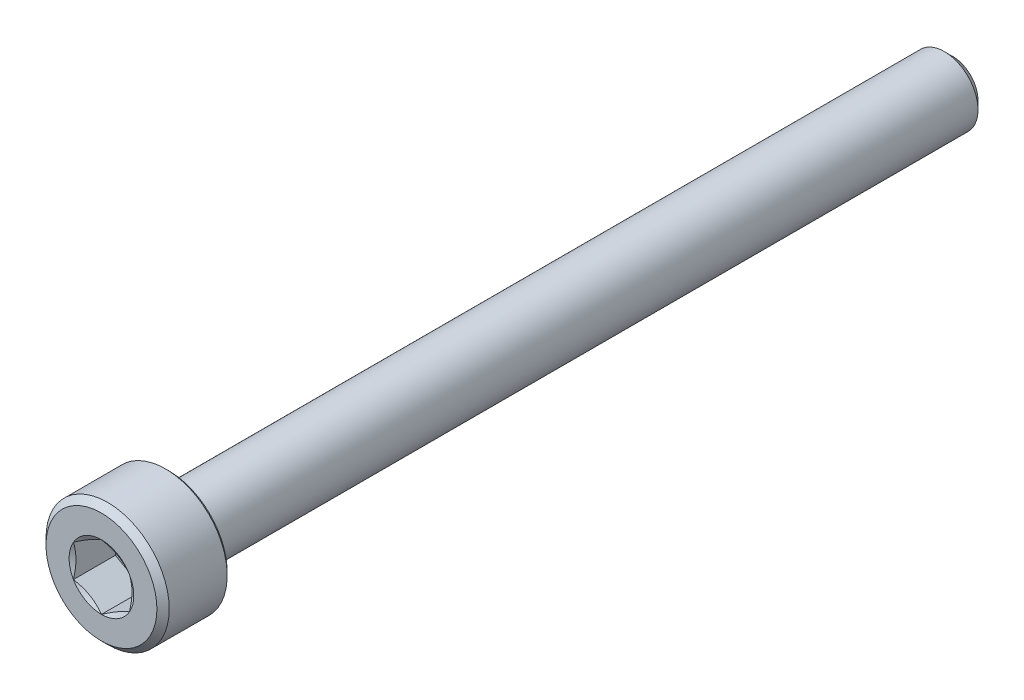
ISO-10303-21;
HEADER;
FILE_DESCRIPTION(('STEP AP214'),'2;1');
FILE_NAME('part.step','',(''),(''),'','','');
FILE_SCHEMA(('AUTOMOTIVE_DESIGN { 1 0 10303 214 1 1 1 1 }'));
ENDSEC;
DATA;
#1=APPLICATION_CONTEXT('core data for automotive mechanical design processes');
#2=APPLICATION_PROTOCOL_DEFINITION('international standard','automotive_design',2000,#1);
#3=PRODUCT_CONTEXT('',#1,'mechanical');
#4=PRODUCT('Part','Part','',(#3));
#5=PRODUCT_RELATED_PRODUCT_CATEGORY('part','',(#4));
#6=PRODUCT_DEFINITION_FORMATION('','',#4);
#7=PRODUCT_DEFINITION_CONTEXT('part definition',#1,'design');
#8=PRODUCT_DEFINITION('design','',#6,#7);
#9=PRODUCT_DEFINITION_SHAPE('','',#8);
#10=(LENGTH_UNIT() NAMED_UNIT(*) SI_UNIT(.MILLI.,.METRE.));
#11=(NAMED_UNIT(*) PLANE_ANGLE_UNIT() SI_UNIT($,.RADIAN.));
#12=(NAMED_UNIT(*) SI_UNIT($,.STERADIAN.) SOLID_ANGLE_UNIT());
#13=UNCERTAINTY_MEASURE_WITH_UNIT(LENGTH_MEASURE(1.E-05),#10,'distance_accuracy_value','');
#14=(GEOMETRIC_REPRESENTATION_CONTEXT(3) GLOBAL_UNCERTAINTY_ASSIGNED_CONTEXT((#13)) GLOBAL_UNIT_ASSIGNED_CONTEXT((#10,
#11,#12)) REPRESENTATION_CONTEXT('',''));
#15=CARTESIAN_POINT('',(0.,0.,0.));
#16=DIRECTION('',(0.,0.,1.));
#17=DIRECTION('',(1.,0.,0.));
#18=AXIS2_PLACEMENT_3D('',#15,#16,#17);
#19=CARTESIAN_POINT('',(0.,2.74999999999999,19.));
#20=DIRECTION('',(0.,0.,1.));
#21=DIRECTION('',(1.,0.,0.));
#22=AXIS2_PLACEMENT_3D('',#19,#20,#21);
#23=PLANE('',#22);
#24=CARTESIAN_POINT('',(0.,0.,19.));
#25=DIRECTION('',(0.,0.,1.));
#26=DIRECTION('',(1.,0.,0.));
#27=AXIS2_PLACEMENT_3D('',#24,#25,#26);
#28=CIRCLE('',#27,2.475);
#29=CARTESIAN_POINT('',(2.475,0.,19.));
#30=VERTEX_POINT('',#29);
#31=EDGE_CURVE('E190',#30,#30,#28,.T.);
#32=ORIENTED_EDGE('',*,*,#31,.T.);
#33=EDGE_LOOP('',(#32));
#34=FACE_BOUND('',#33,.T.);
#35=CARTESIAN_POINT('',(0.,0.,19.));
#36=DIRECTION('',(0.,0.,1.));
#37=DIRECTION('',(1.,0.,0.));
#38=AXIS2_PLACEMENT_3D('',#35,#36,#37);
#39=CIRCLE('',#38,1.44337567297406);
#40=CARTESIAN_POINT('',(1.25,0.721687836487028,19.));
#41=VERTEX_POINT('',#40);
#42=CARTESIAN_POINT('',(0.,1.44337567297406,19.));
#43=VERTEX_POINT('',#42);
#44=EDGE_CURVE('E101',#41,#43,#39,.T.);
#45=ORIENTED_EDGE('',*,*,#44,.F.);
#46=CARTESIAN_POINT('',(1.25,-0.721687836487034,19.));
#47=VERTEX_POINT('',#46);
#48=EDGE_CURVE('E61',#47,#41,#39,.T.);
#49=ORIENTED_EDGE('',*,*,#48,.F.);
#50=CARTESIAN_POINT('',(0.,-1.44337567297407,19.));
#51=VERTEX_POINT('',#50);
#52=EDGE_CURVE('E310',#51,#47,#39,.T.);
#53=ORIENTED_EDGE('',*,*,#52,.F.);
#54=CARTESIAN_POINT('',(-1.25,-0.721687836487033,19.));
#55=VERTEX_POINT('',#54);
#56=EDGE_CURVE('E68',#55,#51,#39,.T.);
#57=ORIENTED_EDGE('',*,*,#56,.F.);
#58=CARTESIAN_POINT('',(-1.25,0.721687836487032,19.));
#59=VERTEX_POINT('',#58);
#60=EDGE_CURVE('E145',#59,#55,#39,.T.);
#61=ORIENTED_EDGE('',*,*,#60,.F.);
#62=EDGE_CURVE('E111',#43,#59,#39,.T.);
#63=ORIENTED_EDGE('',*,*,#62,.F.);
#64=EDGE_LOOP('',(#45,#49,#53,#57,#61,#63));
#65=FACE_BOUND('',#64,.T.);
#66=ADVANCED_FACE('F46',(#34,#65),#23,.T.);
#67=CARTESIAN_POINT('',(0.,0.,-19.));
#68=DIRECTION('',(0.,0.,-1.));
#69=DIRECTION('',(-1.,0.,0.));
#70=AXIS2_PLACEMENT_3D('',#67,#68,#69);
#71=CYLINDRICAL_SURFACE('',#70,2.75);
#72=CARTESIAN_POINT('',(0.,0.,16.1375));
#73=DIRECTION('',(0.,0.,-1.));
#74=DIRECTION('',(-1.,0.,0.));
#75=AXIS2_PLACEMENT_3D('',#72,#73,#74);
#76=CIRCLE('',#75,2.75);
#77=CARTESIAN_POINT('',(-2.75,0.,16.1375));
#78=VERTEX_POINT('',#77);
#79=EDGE_CURVE('E198',#78,#78,#76,.F.);
#80=ORIENTED_EDGE('',*,*,#79,.T.);
#81=EDGE_LOOP('',(#80));
#82=FACE_BOUND('',#81,.T.);
#83=CARTESIAN_POINT('',(0.,0.,18.725));
#84=DIRECTION('',(0.,0.,1.));
#85=DIRECTION('',(1.,0.,0.));
#86=AXIS2_PLACEMENT_3D('',#83,#84,#85);
#87=CIRCLE('',#86,2.75);
#88=CARTESIAN_POINT('',(2.75,0.,18.725));
#89=VERTEX_POINT('',#88);
#90=EDGE_CURVE('E122',#89,#89,#87,.F.);
#91=ORIENTED_EDGE('',*,*,#90,.T.);
#92=EDGE_LOOP('',(#91));
#93=FACE_BOUND('',#92,.T.);
#94=ADVANCED_FACE('F218',(#82,#93),#71,.T.);
#95=CARTESIAN_POINT('',(0.,2.74999999999999,16.));
#96=DIRECTION('',(0.,0.,-1.));
#97=DIRECTION('',(-1.,0.,0.));
#98=AXIS2_PLACEMENT_3D('',#95,#96,#97);
#99=PLANE('',#98);
#100=CARTESIAN_POINT('',(0.,0.,16.));
#101=DIRECTION('',(0.,0.,-1.));
#102=DIRECTION('',(-1.,0.,0.));
#103=AXIS2_PLACEMENT_3D('',#100,#101,#102);
#104=CIRCLE('',#103,2.61250000000001);
#105=CARTESIAN_POINT('',(-2.61250000000001,0.,16.));
#106=VERTEX_POINT('',#105);
#107=EDGE_CURVE('E194',#106,#106,#104,.T.);
#108=ORIENTED_EDGE('',*,*,#107,.T.);
#109=EDGE_LOOP('',(#108));
#110=FACE_BOUND('',#109,.T.);
#111=CARTESIAN_POINT('',(0.,0.,16.));
#112=DIRECTION('',(0.,0.,-1.));
#113=DIRECTION('',(-1.,0.,0.));
#114=AXIS2_PLACEMENT_3D('',#111,#112,#113);
#115=CIRCLE('',#114,1.5);
#116=CARTESIAN_POINT('',(-1.5,0.,16.));
#117=VERTEX_POINT('',#116);
#118=EDGE_CURVE('E123',#117,#117,#115,.T.);
#119=ORIENTED_EDGE('',*,*,#118,.F.);
#120=EDGE_LOOP('',(#119));
#121=FACE_BOUND('',#120,.T.);
#122=ADVANCED_FACE('F226',(#110,#121),#99,.T.);
#123=CARTESIAN_POINT('',(0.,0.,-19.));
#124=DIRECTION('',(0.,0.,-1.));
#125=DIRECTION('',(-1.,0.,0.));
#126=AXIS2_PLACEMENT_3D('',#123,#124,#125);
#127=CYLINDRICAL_SURFACE('',#126,1.5);
#128=CARTESIAN_POINT('',(0.,0.,-18.625));
#129=DIRECTION('',(0.,0.,-1.));
#130=DIRECTION('',(-1.,0.,0.));
#131=AXIS2_PLACEMENT_3D('',#128,#129,#130);
#132=CIRCLE('',#131,1.5);
#133=CARTESIAN_POINT('',(-1.5,0.,-18.625));
#134=VERTEX_POINT('',#133);
#135=EDGE_CURVE('E12',#134,#134,#132,.F.);
#136=ORIENTED_EDGE('',*,*,#135,.T.);
#137=EDGE_LOOP('',(#136));
#138=FACE_BOUND('',#137,.T.);
#139=ORIENTED_EDGE('',*,*,#118,.T.);
#140=EDGE_LOOP('',(#139));
#141=FACE_BOUND('',#140,.T.);
#142=ADVANCED_FACE('F333',(#138,#141),#127,.T.);
#143=CARTESIAN_POINT('',(0.,1.49999999999999,-19.));
#144=DIRECTION('',(0.,0.,-1.));
#145=DIRECTION('',(-1.,0.,0.));
#146=AXIS2_PLACEMENT_3D('',#143,#144,#145);
#147=PLANE('',#146);
#148=CARTESIAN_POINT('',(0.,0.,-19.));
#149=DIRECTION('',(0.,0.,-1.));
#150=DIRECTION('',(-1.,0.,0.));
#151=AXIS2_PLACEMENT_3D('',#148,#149,#150);
#152=CIRCLE('',#151,1.125);
#153=CARTESIAN_POINT('',(-1.125,0.,-19.));
#154=VERTEX_POINT('',#153);
#155=EDGE_CURVE('E55',#154,#154,#152,.T.);
#156=ORIENTED_EDGE('',*,*,#155,.T.);
#157=EDGE_LOOP('',(#156));
#158=FACE_BOUND('',#157,.T.);
#159=ADVANCED_FACE('F205',(#158),#147,.T.);
#160=CARTESIAN_POINT('',(0.,0.,19.));
#161=DIRECTION('',(0.,0.,1.));
#162=DIRECTION('',(1.,0.,0.));
#163=AXIS2_PLACEMENT_3D('',#160,#161,#162);
#164=CONICAL_SURFACE('',#163,1.44337567297406,1.0471975511966);
#165=ORIENTED_EDGE('',*,*,#62,.T.);
#166=CARTESIAN_POINT('',(0.000199999999999545,1.4434911430279,19.000066674666));
#167=CARTESIAN_POINT('',(-0.0547333052317655,1.41177538446486,18.9817459147637));
#168=CARTESIAN_POINT('',(-0.11014078650024,1.37978586023939,18.9650833062006));
#169=CARTESIAN_POINT('',(-0.22191536760034,1.31525277575269,18.9359973039458));
#170=CARTESIAN_POINT('',(-0.278284454841711,1.28270806805991,18.9235842019761));
#171=CARTESIAN_POINT('',(-0.390323974086985,1.21802202146378,18.904259687636));
#172=CARTESIAN_POINT('',(-0.44597715845923,1.1858906404852,18.8972196894474));
#173=CARTESIAN_POINT('',(-0.557545653908392,1.12147653960455,18.8888124326306));
#174=CARTESIAN_POINT('',(-0.613460558937601,1.08919405413422,18.8874382152047));
#175=CARTESIAN_POINT('',(-0.717957921181725,1.02886247391297,18.8902833373679));
#176=CARTESIAN_POINT('',(-0.766555949881316,1.00080438896118,18.89380409882));
#177=CARTESIAN_POINT('',(-0.863435362173239,0.944871034195501,18.9049671126993));
#178=CARTESIAN_POINT('',(-0.911716410192164,0.916995958125017,18.9126131855727));
#179=CARTESIAN_POINT('',(-1.00879588385404,0.860947097873544,18.9317294547005));
#180=CARTESIAN_POINT('',(-1.0575820103519,0.832780414607287,18.9432807569797));
#181=CARTESIAN_POINT('',(-1.1544262522921,0.776867365453646,18.9694983146939));
#182=CARTESIAN_POINT('',(-1.20248561032696,0.749120282155138,18.9841584021391));
#183=CARTESIAN_POINT('',(-1.2502,0.721572366433192,19.000066674666));
#184=B_SPLINE_CURVE_WITH_KNOTS('',3,(#166,#167,#168,#169,#170,#171,#172,#173,#174,#175,#176,
#177,#178,#179,#180,#181,#182,#183),.UNSPECIFIED.,.F.,.F.,(4,2,2,2,2,2,2,2,4),(0.,
0.198150821029559,0.396778196315221,0.5904886173544,0.783961049317182,0.952480056398646,
1.1211553973001,1.2935743034359,1.4656542697693),.UNSPECIFIED.);
#185=EDGE_CURVE('E116',#43,#59,#184,.T.);
#186=ORIENTED_EDGE('',*,*,#185,.F.);
#187=EDGE_LOOP('',(#165,#186));
#188=FACE_BOUND('',#187,.T.);
#189=ADVANCED_FACE('F117',(#188),#164,.F.);
#190=ORIENTED_EDGE('',*,*,#60,.T.);
#191=CARTESIAN_POINT('',(-1.25,-1.86893140179217,19.4647941109243));
#192=CARTESIAN_POINT('',(-1.25,-1.81495202267025,19.4388968384665));
#193=CARTESIAN_POINT('',(-1.25,-1.76084125344196,19.4132686219312));
#194=CARTESIAN_POINT('',(-1.25,-1.65228662652066,19.3627027606134));
#195=CARTESIAN_POINT('',(-1.25,-1.59784271100767,19.3377652401103));
#196=CARTESIAN_POINT('',(-1.25,-1.48823931692675,19.2885939163498));
#197=CARTESIAN_POINT('',(-1.25,-1.43307750108907,19.2643652994868));
#198=CARTESIAN_POINT('',(-1.25,-1.32229188443621,19.2169950705039));
#199=CARTESIAN_POINT('',(-1.25,-1.26666810781962,19.1938534018645));
#200=CARTESIAN_POINT('',(-1.25,-1.15340083047608,19.1483546130678));
#201=CARTESIAN_POINT('',(-1.25,-1.09574254265115,19.1260338154653));
#202=CARTESIAN_POINT('',(-1.25,-0.979741082890175,19.083255476912));
#203=CARTESIAN_POINT('',(-1.25,-0.921397826164638,19.0627981694397));
#204=CARTESIAN_POINT('',(-1.25,-0.745435524772241,19.0050842376762));
#205=CARTESIAN_POINT('',(-1.25,-0.62656193813286,18.9713502149769));
#206=CARTESIAN_POINT('',(-1.25,-0.445873083681239,18.9322204068282));
#207=CARTESIAN_POINT('',(-1.25,-0.385304700192768,18.9210940606189));
#208=CARTESIAN_POINT('',(-1.25,-0.26348659206503,18.9034278522676));
#209=CARTESIAN_POINT('',(-1.25,-0.202236913753247,18.8968876801832));
#210=CARTESIAN_POINT('',(-1.25,-0.0801324468775849,18.8889987810428));
#211=CARTESIAN_POINT('',(-1.25,-0.0192817197887167,18.8875887912582));
#212=CARTESIAN_POINT('',(-1.25,0.102319232701152,18.8899161878862));
#213=CARTESIAN_POINT('',(-1.25,0.163069451645859,18.893653893026));
#214=CARTESIAN_POINT('',(-1.25,0.312961598922923,18.9088980280361));
#215=CARTESIAN_POINT('',(-1.25,0.401813055628259,18.9232612484297));
#216=CARTESIAN_POINT('',(-1.25,0.577788146583198,18.9602998495149));
#217=CARTESIAN_POINT('',(-1.25,0.664909564430747,18.9829852483542));
#218=CARTESIAN_POINT('',(-1.25,0.795209224728791,19.0217374532821));
#219=CARTESIAN_POINT('',(-1.25,0.839061001813533,19.0356229448103));
#220=CARTESIAN_POINT('',(-1.25,0.926308087473953,19.0646784153621));
#221=CARTESIAN_POINT('',(-1.25,0.969703662172459,19.0798475927664));
#222=CARTESIAN_POINT('',(-1.25,1.05609633508794,19.1112501339966));
#223=CARTESIAN_POINT('',(-1.25,1.09909350410933,19.127483304423));
#224=CARTESIAN_POINT('',(-1.25,1.18474903910479,19.1608382439108));
#225=CARTESIAN_POINT('',(-1.25,1.22740734642399,19.1779601631043));
#226=CARTESIAN_POINT('',(-1.25,1.33629459550825,19.2227614292321));
#227=CARTESIAN_POINT('',(-1.25,1.40230581092028,19.2509693835735));
#228=CARTESIAN_POINT('',(-1.25,1.53373213594212,19.3087450811585));
#229=CARTESIAN_POINT('',(-1.25,1.59914720045374,19.3383129262699));
#230=CARTESIAN_POINT('',(-1.25,1.79469680395942,19.4285769200244));
#231=CARTESIAN_POINT('',(-1.25,1.92411390982368,19.4908242731852));
#232=CARTESIAN_POINT('',(-1.25,2.18184246876936,19.6179296229027));
#233=CARTESIAN_POINT('',(-1.25,2.31015236703661,19.682790734765));
#234=CARTESIAN_POINT('',(-1.25,2.56589305685455,19.8141807455314));
#235=CARTESIAN_POINT('',(-1.25,2.69332395754888,19.8807094324427));
#236=CARTESIAN_POINT('',(-1.25,2.93557826301822,20.0085820016458));
#237=CARTESIAN_POINT('',(-1.25,3.05045639113076,20.0698225704122));
#238=CARTESIAN_POINT('',(-1.25,3.27984311898855,20.1930014800409));
#239=CARTESIAN_POINT('',(-1.25,3.39435170485538,20.2549398467261));
#240=CARTESIAN_POINT('',(-1.25,3.62279327872168,20.3791811560561));
#241=CARTESIAN_POINT('',(-1.25,3.73672698995313,20.441482770676));
#242=CARTESIAN_POINT('',(-1.25,3.96436406629495,20.5664914919315));
#243=CARTESIAN_POINT('',(-1.25,4.07806744314788,20.6291985771761));
#244=CARTESIAN_POINT('',(-1.25,4.19168806612954,20.6920543493623));
#245=B_SPLINE_CURVE_WITH_KNOTS('',3,(#191,#192,#193,#194,#195,#196,#197,#198,#199,#200,#201,
#202,#203,#204,#205,#206,#207,#208,#209,#210,#211,#212,#213,#214,#215,#216,#217,#218,#219,#220,
#221,#222,#223,#224,#225,#226,#227,#228,#229,#230,#231,#232,#233,#234,#235,#236,#237,#238,#239,
#240,#241,#242,#243,#244),.UNSPECIFIED.,.F.,.F.,(4,2,2,2,2,2,2,2,2,2,2,2,2,2,2,2,2,2,2,2,2,2,2,
2,2,2,4),(0.,0.179612926712514,0.359257964580623,0.539992735616907,0.720718098311213,
0.906167781883877,1.09164066876278,1.4615401462125,1.64614554413147,1.83073846485712,
2.0131196740194,2.19551217609307,2.46497297688035,2.73475922178117,2.87273702323329,
3.01062928909397,3.14849655975686,3.28638719597089,3.50172172546908,3.7170724117864,
4.14784491349865,4.57914698286382,5.01039449766869,5.40093821140478,5.79149642546539,
6.18106124184771,6.57060567131893),.UNSPECIFIED.);
#246=EDGE_CURVE('E110',#59,#55,#245,.F.);
#247=ORIENTED_EDGE('',*,*,#246,.F.);
#248=EDGE_LOOP('',(#190,#247));
#249=FACE_BOUND('',#248,.T.);
#250=ADVANCED_FACE('F321',(#249),#164,.F.);
#251=ORIENTED_EDGE('',*,*,#56,.T.);
#252=CARTESIAN_POINT('',(-1.2502,-0.721572366433196,19.000066674666));
#253=CARTESIAN_POINT('',(-1.19526669476823,-0.753288124996232,18.9817459147637));
#254=CARTESIAN_POINT('',(-1.13985921349976,-0.785277649221705,18.9650833062006));
#255=CARTESIAN_POINT('',(-1.02808463239966,-0.849810733708405,18.9359973039458));
#256=CARTESIAN_POINT('',(-0.971715545158289,-0.882355441401184,18.9235842019761));
#257=CARTESIAN_POINT('',(-0.859676025913015,-0.947041487997319,18.904259687636));
#258=CARTESIAN_POINT('',(-0.80402284154077,-0.979172868975895,18.8972196894474));
#259=CARTESIAN_POINT('',(-0.692454346091608,-1.04358696985655,18.8888124326306));
#260=CARTESIAN_POINT('',(-0.636539441062399,-1.07586945532688,18.8874382152047));
#261=CARTESIAN_POINT('',(-0.532042078818274,-1.13620103554813,18.8902833373679));
#262=CARTESIAN_POINT('',(-0.483444050118683,-1.16425912049992,18.89380409882));
#263=CARTESIAN_POINT('',(-0.38656463782676,-1.2201924752656,18.9049671126993));
#264=CARTESIAN_POINT('',(-0.338283589807835,-1.24806755133608,18.9126131855727));
#265=CARTESIAN_POINT('',(-0.241204116145956,-1.30411641158755,18.9317294547005));
#266=CARTESIAN_POINT('',(-0.192417989648099,-1.33228309485381,18.9432807569797));
#267=CARTESIAN_POINT('',(-0.0955737477078969,-1.38819614400745,18.9694983146939));
#268=CARTESIAN_POINT('',(-0.0475143896730349,-1.41594322730596,18.9841584021391));
#269=CARTESIAN_POINT('',(0.000200000000000781,-1.4434911430279,19.000066674666));
#270=B_SPLINE_CURVE_WITH_KNOTS('',3,(#252,#253,#254,#255,#256,#257,#258,#259,#260,#261,#262,
#263,#264,#265,#266,#267,#268,#269),.UNSPECIFIED.,.F.,.F.,(4,2,2,2,2,2,2,2,4),(0.,
0.19815082102956,0.396778196315222,0.590488617354401,0.783961049317183,0.952480056398648,
1.1211553973001,1.2935743034359,1.4656542697693),.UNSPECIFIED.);
#271=EDGE_CURVE('E158',#55,#51,#270,.T.);
#272=ORIENTED_EDGE('',*,*,#271,.F.);
#273=EDGE_LOOP('',(#251,#272));
#274=FACE_BOUND('',#273,.T.);
#275=ADVANCED_FACE('F319',(#274),#164,.F.);
#276=ORIENTED_EDGE('',*,*,#52,.T.);
#277=CARTESIAN_POINT('',(-0.000199999999999969,-1.4434911430279,19.000066674666));
#278=CARTESIAN_POINT('',(0.0547333052317653,-1.41177538446487,18.9817459147637));
#279=CARTESIAN_POINT('',(0.11014078650024,-1.3797858602394,18.9650833062006));
#280=CARTESIAN_POINT('',(0.221915367600341,-1.31525277575269,18.9359973039458));
#281=CARTESIAN_POINT('',(0.278284454841711,-1.28270806805992,18.9235842019761));
#282=CARTESIAN_POINT('',(0.390323974086985,-1.21802202146378,18.904259687636));
#283=CARTESIAN_POINT('',(0.445977158459231,-1.1858906404852,18.8972196894474));
#284=CARTESIAN_POINT('',(0.557545653908393,-1.12147653960455,18.8888124326306));
#285=CARTESIAN_POINT('',(0.613460558937601,-1.08919405413422,18.8874382152047));
#286=CARTESIAN_POINT('',(0.717957921181726,-1.02886247391297,18.8902833373679));
#287=CARTESIAN_POINT('',(0.766555949881316,-1.00080438896118,18.89380409882));
#288=CARTESIAN_POINT('',(0.863435362173238,-0.944871034195505,18.9049671126993));
#289=CARTESIAN_POINT('',(0.911716410192163,-0.916995958125022,18.9126131855727));
#290=CARTESIAN_POINT('',(1.00879588385404,-0.860947097873548,18.9317294547005));
#291=CARTESIAN_POINT('',(1.0575820103519,-0.832780414607291,18.9432807569797));
#292=CARTESIAN_POINT('',(1.1544262522921,-0.77686736545365,18.9694983146939));
#293=CARTESIAN_POINT('',(1.20248561032696,-0.749120282155142,18.9841584021391));
#294=CARTESIAN_POINT('',(1.2502,-0.721572366433196,19.000066674666));
#295=B_SPLINE_CURVE_WITH_KNOTS('',3,(#277,#278,#279,#280,#281,#282,#283,#284,#285,#286,#287,
#288,#289,#290,#291,#292,#293,#294),.UNSPECIFIED.,.F.,.F.,(4,2,2,2,2,2,2,2,4),(0.,
0.198150821029561,0.396778196315223,0.590488617354401,0.783961049317183,0.952480056398647,
1.1211553973001,1.2935743034359,1.4656542697693),.UNSPECIFIED.);
#296=EDGE_CURVE('E257',#51,#47,#295,.T.);
#297=ORIENTED_EDGE('',*,*,#296,.F.);
#298=EDGE_LOOP('',(#276,#297));
#299=FACE_BOUND('',#298,.T.);
#300=ADVANCED_FACE('F311',(#299),#164,.F.);
#301=ORIENTED_EDGE('',*,*,#48,.T.);
#302=CARTESIAN_POINT('',(1.25,-1.86893140179217,19.4647941109243));
#303=CARTESIAN_POINT('',(1.25,-1.81495202267025,19.4388968384665));
#304=CARTESIAN_POINT('',(1.25,-1.76084125344196,19.4132686219312));
#305=CARTESIAN_POINT('',(1.25,-1.65228662652066,19.3627027606134));
#306=CARTESIAN_POINT('',(1.25,-1.59784271100767,19.3377652401103));
#307=CARTESIAN_POINT('',(1.25,-1.48823931692675,19.2885939163498));
#308=CARTESIAN_POINT('',(1.25,-1.43307750108907,19.2643652994868));
#309=CARTESIAN_POINT('',(1.25,-1.32229188443621,19.2169950705039));
#310=CARTESIAN_POINT('',(1.25,-1.26666810781962,19.1938534018645));
#311=CARTESIAN_POINT('',(1.25,-1.15340083047608,19.1483546130678));
#312=CARTESIAN_POINT('',(1.25,-1.09574254265115,19.1260338154653));
#313=CARTESIAN_POINT('',(1.25,-0.979741082890175,19.083255476912));
#314=CARTESIAN_POINT('',(1.25,-0.921397826164639,19.0627981694397));
#315=CARTESIAN_POINT('',(1.25,-0.745435524772241,19.0050842376762));
#316=CARTESIAN_POINT('',(1.25,-0.626561938132861,18.9713502149769));
#317=CARTESIAN_POINT('',(1.25,-0.445873083681239,18.9322204068282));
#318=CARTESIAN_POINT('',(1.25,-0.385304700192768,18.9210940606189));
#319=CARTESIAN_POINT('',(1.25,-0.26348659206503,18.9034278522676));
#320=CARTESIAN_POINT('',(1.25,-0.202236913753247,18.8968876801832));
#321=CARTESIAN_POINT('',(1.25,-0.0801324468775847,18.8889987810428));
#322=CARTESIAN_POINT('',(1.25,-0.0192817197887163,18.8875887912582));
#323=CARTESIAN_POINT('',(1.25,0.102319232701152,18.8899161878862));
#324=CARTESIAN_POINT('',(1.25,0.16306945164586,18.893653893026));
#325=CARTESIAN_POINT('',(1.25,0.312961598922924,18.9088980280361));
#326=CARTESIAN_POINT('',(1.25,0.40181305562826,18.9232612484297));
#327=CARTESIAN_POINT('',(1.25,0.577788146583198,18.9602998495149));
#328=CARTESIAN_POINT('',(1.25,0.664909564430748,18.9829852483542));
#329=CARTESIAN_POINT('',(1.25,0.795209224728792,19.0217374532821));
#330=CARTESIAN_POINT('',(1.25,0.839061001813534,19.0356229448103));
#331=CARTESIAN_POINT('',(1.25,0.926308087473953,19.0646784153621));
#332=CARTESIAN_POINT('',(1.25,0.96970366217246,19.0798475927664));
#333=CARTESIAN_POINT('',(1.25,1.05609633508794,19.1112501339966));
#334=CARTESIAN_POINT('',(1.25,1.09909350410933,19.127483304423));
#335=CARTESIAN_POINT('',(1.25,1.1847490391048,19.1608382439108));
#336=CARTESIAN_POINT('',(1.25,1.22740734642399,19.1779601631043));
#337=CARTESIAN_POINT('',(1.25,1.33629459550825,19.2227614292321));
#338=CARTESIAN_POINT('',(1.25,1.40230581092028,19.2509693835735));
#339=CARTESIAN_POINT('',(1.25,1.53373213594212,19.3087450811585));
#340=CARTESIAN_POINT('',(1.25,1.59914720045374,19.3383129262699));
#341=CARTESIAN_POINT('',(1.25,1.79469680395942,19.4285769200244));
#342=CARTESIAN_POINT('',(1.25,1.92411390982368,19.4908242731852));
#343=CARTESIAN_POINT('',(1.25,2.18184246876936,19.6179296229027));
#344=CARTESIAN_POINT('',(1.25,2.31015236703661,19.682790734765));
#345=CARTESIAN_POINT('',(1.25,2.56589305685455,19.8141807455314));
#346=CARTESIAN_POINT('',(1.25,2.69332395754888,19.8807094324427));
#347=CARTESIAN_POINT('',(1.25,2.93557826301822,20.0085820016458));
#348=CARTESIAN_POINT('',(1.25,3.05045639113076,20.0698225704122));
#349=CARTESIAN_POINT('',(1.25,3.27984311898855,20.1930014800409));
#350=CARTESIAN_POINT('',(1.25,3.39435170485538,20.2549398467262));
#351=CARTESIAN_POINT('',(1.25,3.62279327872168,20.3791811560561));
#352=CARTESIAN_POINT('',(1.25,3.73672698995313,20.441482770676));
#353=CARTESIAN_POINT('',(1.25,3.96436406629495,20.5664914919315));
#354=CARTESIAN_POINT('',(1.25,4.07806744314788,20.6291985771761));
#355=CARTESIAN_POINT('',(1.25,4.19168806612954,20.6920543493623));
#356=B_SPLINE_CURVE_WITH_KNOTS('',3,(#302,#303,#304,#305,#306,#307,#308,#309,#310,#311,#312,
#313,#314,#315,#316,#317,#318,#319,#320,#321,#322,#323,#324,#325,#326,#327,#328,#329,#330,#331,
#332,#333,#334,#335,#336,#337,#338,#339,#340,#341,#342,#343,#344,#345,#346,#347,#348,#349,#350,
#351,#352,#353,#354,#355),.UNSPECIFIED.,.F.,.F.,(4,2,2,2,2,2,2,2,2,2,2,2,2,2,2,2,2,2,2,2,2,2,2,
2,2,2,4),(0.,0.179612926712516,0.359257964580625,0.539992735616909,0.720718098311215,
0.906167781883879,1.09164066876279,1.4615401462125,1.64614554413147,1.83073846485713,
2.01311967401941,2.19551217609307,2.46497297688035,2.73475922178117,2.87273702323329,
3.01062928909397,3.14849655975687,3.28638719597089,3.50172172546908,3.7170724117864,
4.14784491349865,4.57914698286382,5.01039449766869,5.40093821140478,5.79149642546539,
6.18106124184772,6.57060567131893),.UNSPECIFIED.);
#357=EDGE_CURVE('E134',#47,#41,#356,.T.);
#358=ORIENTED_EDGE('',*,*,#357,.F.);
#359=EDGE_LOOP('',(#301,#358));
#360=FACE_BOUND('',#359,.T.);
#361=ADVANCED_FACE('F307',(#360),#164,.F.);
#362=ORIENTED_EDGE('',*,*,#44,.T.);
#363=CARTESIAN_POINT('',(1.2502,0.721572366433193,19.000066674666));
#364=CARTESIAN_POINT('',(1.19526669476823,0.753288124996229,18.9817459147637));
#365=CARTESIAN_POINT('',(1.13985921349976,0.785277649221701,18.9650833062006));
#366=CARTESIAN_POINT('',(1.02808463239966,0.849810733708402,18.9359973039458));
#367=CARTESIAN_POINT('',(0.971715545158289,0.882355441401181,18.9235842019761));
#368=CARTESIAN_POINT('',(0.859676025913015,0.947041487997316,18.904259687636));
#369=CARTESIAN_POINT('',(0.80402284154077,0.979172868975891,18.8972196894474));
#370=CARTESIAN_POINT('',(0.692454346091608,1.04358696985655,18.8888124326306));
#371=CARTESIAN_POINT('',(0.636539441062399,1.07586945532687,18.8874382152047));
#372=CARTESIAN_POINT('',(0.532042078818274,1.13620103554812,18.8902833373679));
#373=CARTESIAN_POINT('',(0.483444050118684,1.16425912049992,18.89380409882));
#374=CARTESIAN_POINT('',(0.386564637826761,1.22019247526559,18.9049671126993));
#375=CARTESIAN_POINT('',(0.338283589807836,1.24806755133608,18.9126131855727));
#376=CARTESIAN_POINT('',(0.241204116145956,1.30411641158755,18.9317294547005));
#377=CARTESIAN_POINT('',(0.1924179896481,1.33228309485381,18.9432807569797));
#378=CARTESIAN_POINT('',(0.0955737477078973,1.38819614400745,18.9694983146939));
#379=CARTESIAN_POINT('',(0.0475143896730351,1.41594322730595,18.9841584021391));
#380=CARTESIAN_POINT('',(-0.00020000000000046,1.4434911430279,19.000066674666));
#381=B_SPLINE_CURVE_WITH_KNOTS('',3,(#363,#364,#365,#366,#367,#368,#369,#370,#371,#372,#373,
#374,#375,#376,#377,#378,#379,#380),.UNSPECIFIED.,.F.,.F.,(4,2,2,2,2,2,2,2,4),(0.,
0.198150821029558,0.396778196315221,0.5904886173544,0.783961049317182,0.952480056398646,
1.1211553973001,1.2935743034359,1.4656542697693),.UNSPECIFIED.);
#382=EDGE_CURVE('E105',#41,#43,#381,.T.);
#383=ORIENTED_EDGE('',*,*,#382,.F.);
#384=EDGE_LOOP('',(#362,#383));
#385=FACE_BOUND('',#384,.T.);
#386=ADVANCED_FACE('F103',(#385),#164,.F.);
#387=CARTESIAN_POINT('',(0.,0.,17.125));
#388=DIRECTION('',(0.,0.,1.));
#389=DIRECTION('',(1.,0.,0.));
#390=AXIS2_PLACEMENT_3D('',#387,#388,#389);
#391=PLANE('',#390);
#392=DIRECTION('',(-0.866025403784439,0.5,0.));
#393=VECTOR('',#392,1.);
#394=CARTESIAN_POINT('',(1.25,0.721687836487031,17.125));
#395=LINE('',#394,#393);
#396=CARTESIAN_POINT('',(1.25,0.721687836487031,17.125));
#397=VERTEX_POINT('',#396);
#398=CARTESIAN_POINT('',(0.,1.44337567297406,17.125));
#399=VERTEX_POINT('',#398);
#400=EDGE_CURVE('E133',#397,#399,#395,.T.);
#401=ORIENTED_EDGE('',*,*,#400,.T.);
#402=DIRECTION('',(-0.866025403784438,-0.5,0.));
#403=VECTOR('',#402,1.);
#404=CARTESIAN_POINT('',(0.,1.44337567297406,17.125));
#405=LINE('',#404,#403);
#406=CARTESIAN_POINT('',(-1.25,0.72168783648703,17.125));
#407=VERTEX_POINT('',#406);
#408=EDGE_CURVE('E138',#399,#407,#405,.T.);
#409=ORIENTED_EDGE('',*,*,#408,.T.);
#410=DIRECTION('',(0.,-1.,0.));
#411=VECTOR('',#410,1.);
#412=CARTESIAN_POINT('',(-1.25,0.72168783648703,17.125));
#413=LINE('',#412,#411);
#414=CARTESIAN_POINT('',(-1.25,-0.721687836487034,17.125));
#415=VERTEX_POINT('',#414);
#416=EDGE_CURVE('E271',#407,#415,#413,.T.);
#417=ORIENTED_EDGE('',*,*,#416,.T.);
#418=DIRECTION('',(0.866025403784439,-0.5,0.));
#419=VECTOR('',#418,1.);
#420=CARTESIAN_POINT('',(-1.25,-0.721687836487034,17.125));
#421=LINE('',#420,#419);
#422=CARTESIAN_POINT('',(0.,-1.44337567297407,17.125));
#423=VERTEX_POINT('',#422);
#424=EDGE_CURVE('E275',#415,#423,#421,.T.);
#425=ORIENTED_EDGE('',*,*,#424,.T.);
#426=DIRECTION('',(0.866025403784439,0.5,0.));
#427=VECTOR('',#426,1.);
#428=CARTESIAN_POINT('',(0.,-1.44337567297407,17.125));
#429=LINE('',#428,#427);
#430=CARTESIAN_POINT('',(1.25,-0.721687836487034,17.125));
#431=VERTEX_POINT('',#430);
#432=EDGE_CURVE('E279',#423,#431,#429,.T.);
#433=ORIENTED_EDGE('',*,*,#432,.T.);
#434=DIRECTION('',(0.,1.,0.));
#435=VECTOR('',#434,1.);
#436=CARTESIAN_POINT('',(1.25,-0.721687836487034,17.125));
#437=LINE('',#436,#435);
#438=EDGE_CURVE('E142',#431,#397,#437,.T.);
#439=ORIENTED_EDGE('',*,*,#438,.T.);
#440=EDGE_LOOP('',(#401,#409,#417,#425,#433,#439));
#441=FACE_BOUND('',#440,.T.);
#442=ADVANCED_FACE('F178',(#441),#391,.T.);
#443=CARTESIAN_POINT('',(0.,1.44337567297406,17.125));
#444=DIRECTION('',(-0.5,0.866025403784438,0.));
#445=DIRECTION('',(-0.866025403784439,-0.5,0.));
#446=AXIS2_PLACEMENT_3D('',#443,#444,#445);
#447=PLANE('',#446);
#448=DIRECTION('',(0.,0.,1.));
#449=VECTOR('',#448,1.);
#450=CARTESIAN_POINT('',(0.,1.44337567297406,17.125));
#451=LINE('',#450,#449);
#452=EDGE_CURVE('E129',#399,#43,#451,.T.);
#453=ORIENTED_EDGE('',*,*,#452,.T.);
#454=ORIENTED_EDGE('',*,*,#185,.T.);
#455=DIRECTION('',(0.,0.,1.));
#456=VECTOR('',#455,1.);
#457=CARTESIAN_POINT('',(-1.25,0.72168783648703,17.125));
#458=LINE('',#457,#456);
#459=EDGE_CURVE('E141',#407,#59,#458,.T.);
#460=ORIENTED_EDGE('',*,*,#459,.F.);
#461=ORIENTED_EDGE('',*,*,#408,.F.);
#462=EDGE_LOOP('',(#453,#454,#460,#461));
#463=FACE_BOUND('',#462,.T.);
#464=ADVANCED_FACE('F136',(#463),#447,.F.);
#465=CARTESIAN_POINT('',(-1.25,0.72168783648703,17.125));
#466=DIRECTION('',(-1.,0.,0.));
#467=DIRECTION('',(0.,-1.,0.));
#468=AXIS2_PLACEMENT_3D('',#465,#466,#467);
#469=PLANE('',#468);
#470=ORIENTED_EDGE('',*,*,#459,.T.);
#471=ORIENTED_EDGE('',*,*,#246,.T.);
#472=DIRECTION('',(0.,0.,1.));
#473=VECTOR('',#472,1.);
#474=CARTESIAN_POINT('',(-1.25,-0.721687836487034,17.125));
#475=LINE('',#474,#473);
#476=EDGE_CURVE('E295',#415,#55,#475,.T.);
#477=ORIENTED_EDGE('',*,*,#476,.F.);
#478=ORIENTED_EDGE('',*,*,#416,.F.);
#479=EDGE_LOOP('',(#470,#471,#477,#478));
#480=FACE_BOUND('',#479,.T.);
#481=ADVANCED_FACE('F167',(#480),#469,.F.);
#482=CARTESIAN_POINT('',(-1.25,-0.721687836487034,17.125));
#483=DIRECTION('',(-0.5,-0.866025403784439,0.));
#484=DIRECTION('',(0.866025403784439,-0.5,0.));
#485=AXIS2_PLACEMENT_3D('',#482,#483,#484);
#486=PLANE('',#485);
#487=ORIENTED_EDGE('',*,*,#476,.T.);
#488=ORIENTED_EDGE('',*,*,#271,.T.);
#489=DIRECTION('',(0.,0.,1.));
#490=VECTOR('',#489,1.);
#491=CARTESIAN_POINT('',(0.,-1.44337567297407,17.125));
#492=LINE('',#491,#490);
#493=EDGE_CURVE('E291',#423,#51,#492,.T.);
#494=ORIENTED_EDGE('',*,*,#493,.F.);
#495=ORIENTED_EDGE('',*,*,#424,.F.);
#496=EDGE_LOOP('',(#487,#488,#494,#495));
#497=FACE_BOUND('',#496,.T.);
#498=ADVANCED_FACE('F171',(#497),#486,.F.);
#499=CARTESIAN_POINT('',(0.,-1.44337567297407,17.125));
#500=DIRECTION('',(0.5,-0.866025403784439,0.));
#501=DIRECTION('',(0.866025403784439,0.5,0.));
#502=AXIS2_PLACEMENT_3D('',#499,#500,#501);
#503=PLANE('',#502);
#504=ORIENTED_EDGE('',*,*,#493,.T.);
#505=ORIENTED_EDGE('',*,*,#296,.T.);
#506=DIRECTION('',(0.,0.,1.));
#507=VECTOR('',#506,1.);
#508=CARTESIAN_POINT('',(1.25,-0.721687836487034,17.125));
#509=LINE('',#508,#507);
#510=EDGE_CURVE('E288',#431,#47,#509,.T.);
#511=ORIENTED_EDGE('',*,*,#510,.F.);
#512=ORIENTED_EDGE('',*,*,#432,.F.);
#513=EDGE_LOOP('',(#504,#505,#511,#512));
#514=FACE_BOUND('',#513,.T.);
#515=ADVANCED_FACE('F242',(#514),#503,.F.);
#516=CARTESIAN_POINT('',(1.25,-0.721687836487034,17.125));
#517=DIRECTION('',(1.,0.,0.));
#518=DIRECTION('',(0.,0.,-1.));
#519=AXIS2_PLACEMENT_3D('',#516,#517,#518);
#520=PLANE('',#519);
#521=ORIENTED_EDGE('',*,*,#510,.T.);
#522=ORIENTED_EDGE('',*,*,#357,.T.);
#523=DIRECTION('',(0.,0.,1.));
#524=VECTOR('',#523,1.);
#525=CARTESIAN_POINT('',(1.25,0.721687836487031,17.125));
#526=LINE('',#525,#524);
#527=EDGE_CURVE('E131',#397,#41,#526,.T.);
#528=ORIENTED_EDGE('',*,*,#527,.F.);
#529=ORIENTED_EDGE('',*,*,#438,.F.);
#530=EDGE_LOOP('',(#521,#522,#528,#529));
#531=FACE_BOUND('',#530,.T.);
#532=ADVANCED_FACE('F234',(#531),#520,.F.);
#533=CARTESIAN_POINT('',(1.25,0.721687836487031,17.125));
#534=DIRECTION('',(0.5,0.866025403784439,0.));
#535=DIRECTION('',(-0.866025403784439,0.5,0.));
#536=AXIS2_PLACEMENT_3D('',#533,#534,#535);
#537=PLANE('',#536);
#538=ORIENTED_EDGE('',*,*,#527,.T.);
#539=ORIENTED_EDGE('',*,*,#382,.T.);
#540=ORIENTED_EDGE('',*,*,#452,.F.);
#541=ORIENTED_EDGE('',*,*,#400,.F.);
#542=EDGE_LOOP('',(#538,#539,#540,#541));
#543=FACE_BOUND('',#542,.T.);
#544=ADVANCED_FACE('F127',(#543),#537,.F.);
#545=CARTESIAN_POINT('',(0.,0.,18.725));
#546=DIRECTION('',(0.,0.,-1.));
#547=DIRECTION('',(-1.,0.,0.));
#548=AXIS2_PLACEMENT_3D('',#545,#546,#547);
#549=CONICAL_SURFACE('',#548,2.75,0.78539816339744);
#550=ORIENTED_EDGE('',*,*,#31,.F.);
#551=EDGE_LOOP('',(#550));
#552=FACE_BOUND('',#551,.T.);
#553=ORIENTED_EDGE('',*,*,#90,.F.);
#554=EDGE_LOOP('',(#553));
#555=FACE_BOUND('',#554,.T.);
#556=ADVANCED_FACE('F214',(#552,#555),#549,.T.);
#557=CARTESIAN_POINT('',(0.,0.,16.));
#558=DIRECTION('',(0.,0.,1.));
#559=DIRECTION('',(1.,0.,0.));
#560=AXIS2_PLACEMENT_3D('',#557,#558,#559);
#561=CONICAL_SURFACE('',#560,2.61250000000001,0.785398163397444);
#562=ORIENTED_EDGE('',*,*,#79,.F.);
#563=EDGE_LOOP('',(#562));
#564=FACE_BOUND('',#563,.T.);
#565=ORIENTED_EDGE('',*,*,#107,.F.);
#566=EDGE_LOOP('',(#565));
#567=FACE_BOUND('',#566,.T.);
#568=ADVANCED_FACE('F208',(#564,#567),#561,.T.);
#569=CARTESIAN_POINT('',(0.,0.,-19.));
#570=DIRECTION('',(0.,0.,1.));
#571=DIRECTION('',(1.,0.,0.));
#572=AXIS2_PLACEMENT_3D('',#569,#570,#571);
#573=CONICAL_SURFACE('',#572,1.125,0.785398163397444);
#574=ORIENTED_EDGE('',*,*,#135,.F.);
#575=EDGE_LOOP('',(#574));
#576=FACE_BOUND('',#575,.T.);
#577=ORIENTED_EDGE('',*,*,#155,.F.);
#578=EDGE_LOOP('',(#577));
#579=FACE_BOUND('',#578,.T.);
#580=ADVANCED_FACE('F48',(#576,#579),#573,.T.);
#581=CLOSED_SHELL('',(#66,#94,#122,#142,#159,#189,#250,#275,#300,#361,#386,#442,#464,#481,#498,
#515,#532,#544,#556,#568,#580));
#582=MANIFOLD_SOLID_BREP('B2',#581);
#583=ADVANCED_BREP_SHAPE_REPRESENTATION('',(#18,#582),#14);
#584=SHAPE_DEFINITION_REPRESENTATION(#9,#583);
ENDSEC;
END-ISO-10303-21;
